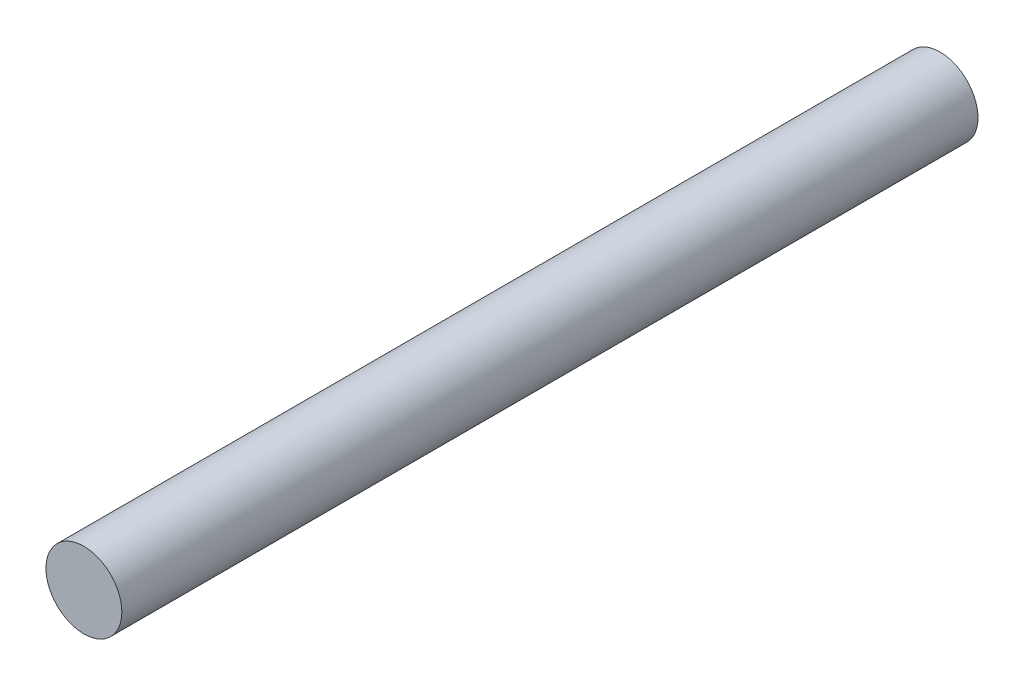
ISO-10303-21;
HEADER;
FILE_DESCRIPTION(('STEP AP214'),'2;1');
FILE_NAME('part.step','',(''),(''),'','','');
FILE_SCHEMA(('AUTOMOTIVE_DESIGN { 1 0 10303 214 1 1 1 1 }'));
ENDSEC;
DATA;
#1=APPLICATION_CONTEXT('core data for automotive mechanical design processes');
#2=APPLICATION_PROTOCOL_DEFINITION('international standard','automotive_design',2000,#1);
#3=PRODUCT_CONTEXT('',#1,'mechanical');
#4=PRODUCT('Part','Part','',(#3));
#5=PRODUCT_RELATED_PRODUCT_CATEGORY('part','',(#4));
#6=PRODUCT_DEFINITION_FORMATION('','',#4);
#7=PRODUCT_DEFINITION_CONTEXT('part definition',#1,'design');
#8=PRODUCT_DEFINITION('design','',#6,#7);
#9=PRODUCT_DEFINITION_SHAPE('','',#8);
#10=(LENGTH_UNIT() NAMED_UNIT(*) SI_UNIT(.MILLI.,.METRE.));
#11=(NAMED_UNIT(*) PLANE_ANGLE_UNIT() SI_UNIT($,.RADIAN.));
#12=(NAMED_UNIT(*) SI_UNIT($,.STERADIAN.) SOLID_ANGLE_UNIT());
#13=UNCERTAINTY_MEASURE_WITH_UNIT(LENGTH_MEASURE(1.E-05),#10,'distance_accuracy_value','');
#14=(GEOMETRIC_REPRESENTATION_CONTEXT(3) GLOBAL_UNCERTAINTY_ASSIGNED_CONTEXT((#13)) GLOBAL_UNIT_ASSIGNED_CONTEXT((#10,
#11,#12)) REPRESENTATION_CONTEXT('',''));
#15=CARTESIAN_POINT('',(0.,0.,0.));
#16=DIRECTION('',(0.,0.,1.));
#17=DIRECTION('',(1.,0.,0.));
#18=AXIS2_PLACEMENT_3D('',#15,#16,#17);
#19=CARTESIAN_POINT('',(0.,0.,38.1));
#20=DIRECTION('',(0.,0.,-1.));
#21=DIRECTION('',(-1.,0.,0.));
#22=AXIS2_PLACEMENT_3D('',#19,#20,#21);
#23=CYLINDRICAL_SURFACE('',#22,3.3782);
#24=CARTESIAN_POINT('',(0.,0.,38.1));
#25=DIRECTION('',(0.,0.,1.));
#26=DIRECTION('',(1.,0.,0.));
#27=AXIS2_PLACEMENT_3D('',#24,#25,#26);
#28=CIRCLE('',#27,3.3782);
#29=CARTESIAN_POINT('',(3.3782,0.,38.1));
#30=VERTEX_POINT('',#29);
#31=EDGE_CURVE('E10',#30,#30,#28,.T.);
#32=ORIENTED_EDGE('',*,*,#31,.F.);
#33=EDGE_LOOP('',(#32));
#34=FACE_BOUND('',#33,.T.);
#35=CARTESIAN_POINT('',(0.,0.,-38.1));
#36=DIRECTION('',(0.,0.,1.));
#37=DIRECTION('',(1.,0.,0.));
#38=AXIS2_PLACEMENT_3D('',#35,#36,#37);
#39=CIRCLE('',#38,3.3782);
#40=CARTESIAN_POINT('',(3.3782,0.,-38.1));
#41=VERTEX_POINT('',#40);
#42=EDGE_CURVE('E35',#41,#41,#39,.T.);
#43=ORIENTED_EDGE('',*,*,#42,.T.);
#44=EDGE_LOOP('',(#43));
#45=FACE_BOUND('',#44,.T.);
#46=ADVANCED_FACE('F32',(#34,#45),#23,.T.);
#47=CARTESIAN_POINT('',(0.,0.,38.1));
#48=DIRECTION('',(0.,0.,1.));
#49=DIRECTION('',(1.,0.,0.));
#50=AXIS2_PLACEMENT_3D('',#47,#48,#49);
#51=PLANE('',#50);
#52=ORIENTED_EDGE('',*,*,#31,.T.);
#53=EDGE_LOOP('',(#52));
#54=FACE_BOUND('',#53,.T.);
#55=ADVANCED_FACE('F47',(#54),#51,.T.);
#56=CARTESIAN_POINT('',(0.,0.,-38.1));
#57=DIRECTION('',(0.,0.,1.));
#58=DIRECTION('',(1.,0.,0.));
#59=AXIS2_PLACEMENT_3D('',#56,#57,#58);
#60=PLANE('',#59);
#61=ORIENTED_EDGE('',*,*,#42,.F.);
#62=EDGE_LOOP('',(#61));
#63=FACE_BOUND('',#62,.T.);
#64=ADVANCED_FACE('F45',(#63),#60,.F.);
#65=CLOSED_SHELL('',(#46,#55,#64));
#66=MANIFOLD_SOLID_BREP('B2',#65);
#67=ADVANCED_BREP_SHAPE_REPRESENTATION('',(#18,#66),#14);
#68=SHAPE_DEFINITION_REPRESENTATION(#9,#67);
ENDSEC;
END-ISO-10303-21;
